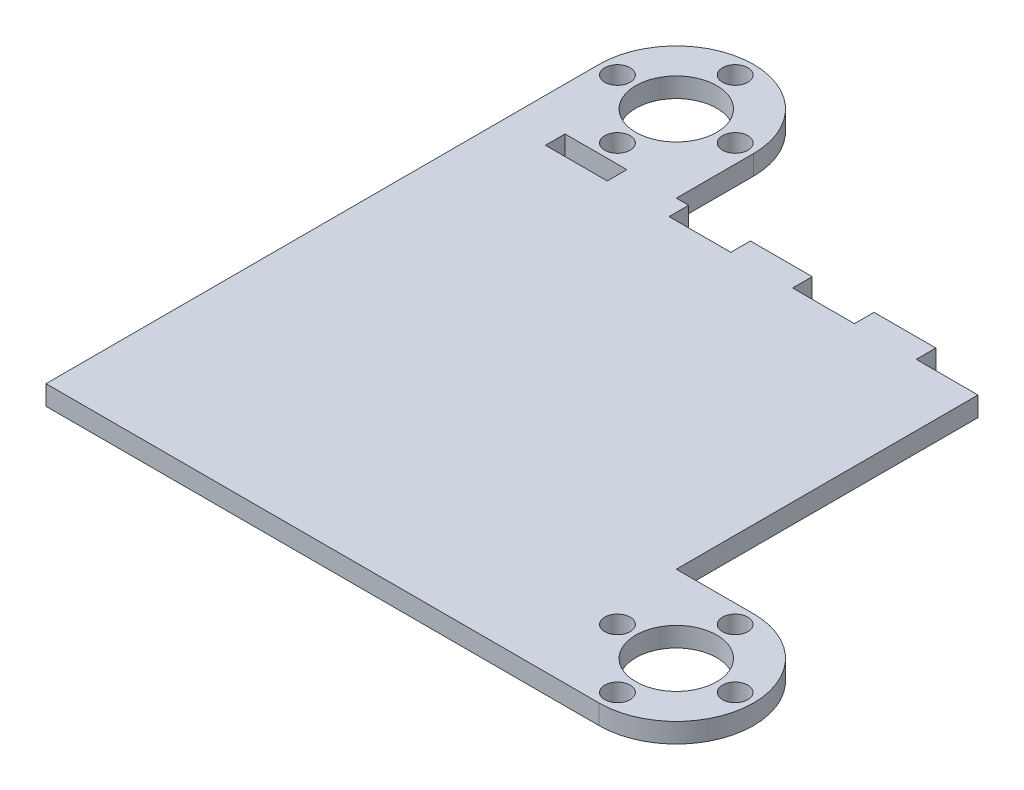
ISO-10303-21;
HEADER;
FILE_DESCRIPTION(('STEP AP214'),'2;1');
FILE_NAME('part.step','',(''),(''),'','','');
FILE_SCHEMA(('AUTOMOTIVE_DESIGN { 1 0 10303 214 1 1 1 1 }'));
ENDSEC;
DATA;
#1=APPLICATION_CONTEXT('core data for automotive mechanical design processes');
#2=APPLICATION_PROTOCOL_DEFINITION('international standard','automotive_design',2000,#1);
#3=PRODUCT_CONTEXT('',#1,'mechanical');
#4=PRODUCT('Part','Part','',(#3));
#5=PRODUCT_RELATED_PRODUCT_CATEGORY('part','',(#4));
#6=PRODUCT_DEFINITION_FORMATION('','',#4);
#7=PRODUCT_DEFINITION_CONTEXT('part definition',#1,'design');
#8=PRODUCT_DEFINITION('design','',#6,#7);
#9=PRODUCT_DEFINITION_SHAPE('','',#8);
#10=(LENGTH_UNIT() NAMED_UNIT(*) SI_UNIT(.MILLI.,.METRE.));
#11=(NAMED_UNIT(*) PLANE_ANGLE_UNIT() SI_UNIT($,.RADIAN.));
#12=(NAMED_UNIT(*) SI_UNIT($,.STERADIAN.) SOLID_ANGLE_UNIT());
#13=UNCERTAINTY_MEASURE_WITH_UNIT(LENGTH_MEASURE(1.E-05),#10,'distance_accuracy_value','');
#14=(GEOMETRIC_REPRESENTATION_CONTEXT(3) GLOBAL_UNCERTAINTY_ASSIGNED_CONTEXT((#13)) GLOBAL_UNIT_ASSIGNED_CONTEXT((#10,
#11,#12)) REPRESENTATION_CONTEXT('',''));
#15=CARTESIAN_POINT('',(0.,0.,0.));
#16=DIRECTION('',(0.,0.,1.));
#17=DIRECTION('',(1.,0.,0.));
#18=AXIS2_PLACEMENT_3D('',#15,#16,#17);
#19=CARTESIAN_POINT('',(0.,3.175,-38.5));
#20=DIRECTION('',(0.,0.,-1.));
#21=DIRECTION('',(-1.,0.,0.));
#22=AXIS2_PLACEMENT_3D('',#19,#20,#21);
#23=PLANE('',#22);
#24=DIRECTION('',(0.,1.,0.));
#25=VECTOR('',#24,1.);
#26=CARTESIAN_POINT('',(28.5,0.,-38.5));
#27=LINE('',#26,#25);
#28=CARTESIAN_POINT('',(28.5,0.,-38.5));
#29=VERTEX_POINT('',#28);
#30=CARTESIAN_POINT('',(28.5,3.175,-38.5));
#31=VERTEX_POINT('',#30);
#32=EDGE_CURVE('E193',#29,#31,#27,.T.);
#33=ORIENTED_EDGE('',*,*,#32,.F.);
#34=DIRECTION('',(1.,0.,0.));
#35=VECTOR('',#34,1.);
#36=CARTESIAN_POINT('',(0.,0.,-38.5));
#37=LINE('',#36,#35);
#38=CARTESIAN_POINT('',(18.5,0.,-38.4999999999999));
#39=VERTEX_POINT('',#38);
#40=EDGE_CURVE('E205',#39,#29,#37,.T.);
#41=ORIENTED_EDGE('',*,*,#40,.F.);
#42=DIRECTION('',(0.,1.,0.));
#43=VECTOR('',#42,1.);
#44=CARTESIAN_POINT('',(18.5,0.,-38.4999999999999));
#45=LINE('',#44,#43);
#46=CARTESIAN_POINT('',(18.5,3.175,-38.4999999999999));
#47=VERTEX_POINT('',#46);
#48=EDGE_CURVE('E553',#39,#47,#45,.T.);
#49=ORIENTED_EDGE('',*,*,#48,.T.);
#50=DIRECTION('',(1.,0.,0.));
#51=VECTOR('',#50,1.);
#52=CARTESIAN_POINT('',(0.,3.175,-38.5));
#53=LINE('',#52,#51);
#54=EDGE_CURVE('E207',#47,#31,#53,.T.);
#55=ORIENTED_EDGE('',*,*,#54,.T.);
#56=EDGE_LOOP('',(#33,#41,#49,#55));
#57=FACE_BOUND('',#56,.T.);
#58=ADVANCED_FACE('F41',(#57),#23,.T.);
#59=DIRECTION('',(0.,1.,0.));
#60=VECTOR('',#59,1.);
#61=CARTESIAN_POINT('',(8.49999999999999,0.,-38.4999999999999));
#62=LINE('',#61,#60);
#63=CARTESIAN_POINT('',(8.49999999999999,0.,-38.4999999999999));
#64=VERTEX_POINT('',#63);
#65=CARTESIAN_POINT('',(8.49999999999999,3.175,-38.4999999999999));
#66=VERTEX_POINT('',#65);
#67=EDGE_CURVE('E550',#64,#66,#62,.T.);
#68=ORIENTED_EDGE('',*,*,#67,.F.);
#69=CARTESIAN_POINT('',(-1.50000000000001,0.,-38.4999999999997));
#70=VERTEX_POINT('',#69);
#71=EDGE_CURVE('E217',#70,#64,#37,.T.);
#72=ORIENTED_EDGE('',*,*,#71,.F.);
#73=DIRECTION('',(0.,1.,0.));
#74=VECTOR('',#73,1.);
#75=CARTESIAN_POINT('',(-1.50000000000001,0.,-38.4999999999997));
#76=LINE('',#75,#74);
#77=CARTESIAN_POINT('',(-1.50000000000001,3.175,-38.4999999999997));
#78=VERTEX_POINT('',#77);
#79=EDGE_CURVE('E447',#70,#78,#76,.T.);
#80=ORIENTED_EDGE('',*,*,#79,.T.);
#81=EDGE_CURVE('E353',#78,#66,#53,.T.);
#82=ORIENTED_EDGE('',*,*,#81,.T.);
#83=EDGE_LOOP('',(#68,#72,#80,#82));
#84=FACE_BOUND('',#83,.T.);
#85=ADVANCED_FACE('F419',(#84),#23,.T.);
#86=CARTESIAN_POINT('',(-38.5,3.175,0.));
#87=DIRECTION('',(1.,0.,0.));
#88=DIRECTION('',(0.,0.,-1.));
#89=AXIS2_PLACEMENT_3D('',#86,#87,#88);
#90=PLANE('',#89);
#91=DIRECTION('',(0.,0.,1.));
#92=VECTOR('',#91,1.);
#93=CARTESIAN_POINT('',(-38.5,0.,0.));
#94=LINE('',#93,#92);
#95=CARTESIAN_POINT('',(-38.5,0.,-51.));
#96=VERTEX_POINT('',#95);
#97=CARTESIAN_POINT('',(-38.5,0.,38.5));
#98=VERTEX_POINT('',#97);
#99=EDGE_CURVE('E322',#96,#98,#94,.T.);
#100=ORIENTED_EDGE('',*,*,#99,.T.);
#101=DIRECTION('',(0.,-1.,0.));
#102=VECTOR('',#101,1.);
#103=CARTESIAN_POINT('',(-38.5,3.175,38.5));
#104=LINE('',#103,#102);
#105=CARTESIAN_POINT('',(-38.5,3.175,38.5));
#106=VERTEX_POINT('',#105);
#107=EDGE_CURVE('E11',#106,#98,#104,.T.);
#108=ORIENTED_EDGE('',*,*,#107,.F.);
#109=DIRECTION('',(0.,0.,1.));
#110=VECTOR('',#109,1.);
#111=CARTESIAN_POINT('',(-38.5,3.175,0.));
#112=LINE('',#111,#110);
#113=CARTESIAN_POINT('',(-38.5,3.175,-51.));
#114=VERTEX_POINT('',#113);
#115=EDGE_CURVE('E280',#114,#106,#112,.T.);
#116=ORIENTED_EDGE('',*,*,#115,.F.);
#117=DIRECTION('',(0.,-1.,0.));
#118=VECTOR('',#117,1.);
#119=CARTESIAN_POINT('',(-38.5,3.175,-51.));
#120=LINE('',#119,#118);
#121=EDGE_CURVE('E281',#114,#96,#120,.T.);
#122=ORIENTED_EDGE('',*,*,#121,.T.);
#123=EDGE_LOOP('',(#100,#108,#116,#122));
#124=FACE_BOUND('',#123,.T.);
#125=ADVANCED_FACE('F43',(#124),#90,.F.);
#126=CARTESIAN_POINT('',(0.,3.175,38.5));
#127=DIRECTION('',(0.,0.,1.));
#128=DIRECTION('',(1.,0.,0.));
#129=AXIS2_PLACEMENT_3D('',#126,#127,#128);
#130=PLANE('',#129);
#131=DIRECTION('',(-1.,0.,0.));
#132=VECTOR('',#131,1.);
#133=CARTESIAN_POINT('',(0.,0.,38.5));
#134=LINE('',#133,#132);
#135=CARTESIAN_POINT('',(51.,0.,38.5));
#136=VERTEX_POINT('',#135);
#137=EDGE_CURVE('E314',#136,#98,#134,.T.);
#138=ORIENTED_EDGE('',*,*,#137,.F.);
#139=DIRECTION('',(0.,-1.,0.));
#140=VECTOR('',#139,1.);
#141=CARTESIAN_POINT('',(51.,3.175,38.5));
#142=LINE('',#141,#140);
#143=CARTESIAN_POINT('',(51.,3.175,38.5));
#144=VERTEX_POINT('',#143);
#145=EDGE_CURVE('E50',#144,#136,#142,.T.);
#146=ORIENTED_EDGE('',*,*,#145,.F.);
#147=DIRECTION('',(-1.,0.,0.));
#148=VECTOR('',#147,1.);
#149=CARTESIAN_POINT('',(0.,3.175,38.5));
#150=LINE('',#149,#148);
#151=EDGE_CURVE('E344',#144,#106,#150,.T.);
#152=ORIENTED_EDGE('',*,*,#151,.T.);
#153=ORIENTED_EDGE('',*,*,#107,.T.);
#154=EDGE_LOOP('',(#138,#146,#152,#153));
#155=FACE_BOUND('',#154,.T.);
#156=ADVANCED_FACE('F318',(#155),#130,.T.);
#157=CARTESIAN_POINT('',(51.,3.175,26.));
#158=DIRECTION('',(0.,-1.,0.));
#159=DIRECTION('',(0.,0.,-1.));
#160=AXIS2_PLACEMENT_3D('',#157,#158,#159);
#161=CYLINDRICAL_SURFACE('',#160,12.5);
#162=CARTESIAN_POINT('',(51.,0.,26.));
#163=DIRECTION('',(0.,1.,0.));
#164=DIRECTION('',(0.,0.,1.));
#165=AXIS2_PLACEMENT_3D('',#162,#163,#164);
#166=CIRCLE('',#165,12.5);
#167=CARTESIAN_POINT('',(51.,0.,13.5));
#168=VERTEX_POINT('',#167);
#169=EDGE_CURVE('E305',#136,#168,#166,.T.);
#170=ORIENTED_EDGE('',*,*,#169,.T.);
#171=DIRECTION('',(0.,-1.,0.));
#172=VECTOR('',#171,1.);
#173=CARTESIAN_POINT('',(51.,3.175,13.5));
#174=LINE('',#173,#172);
#175=CARTESIAN_POINT('',(51.,3.175,13.5));
#176=VERTEX_POINT('',#175);
#177=EDGE_CURVE('E296',#176,#168,#174,.T.);
#178=ORIENTED_EDGE('',*,*,#177,.F.);
#179=CARTESIAN_POINT('',(51.,3.175,26.));
#180=DIRECTION('',(0.,1.,0.));
#181=DIRECTION('',(0.,0.,1.));
#182=AXIS2_PLACEMENT_3D('',#179,#180,#181);
#183=CIRCLE('',#182,12.5);
#184=EDGE_CURVE('E306',#144,#176,#183,.T.);
#185=ORIENTED_EDGE('',*,*,#184,.F.);
#186=ORIENTED_EDGE('',*,*,#145,.T.);
#187=EDGE_LOOP('',(#170,#178,#185,#186));
#188=FACE_BOUND('',#187,.T.);
#189=ADVANCED_FACE('F303',(#188),#161,.T.);
#190=CARTESIAN_POINT('',(0.,3.175,13.5));
#191=DIRECTION('',(0.,0.,1.));
#192=DIRECTION('',(1.,0.,0.));
#193=AXIS2_PLACEMENT_3D('',#190,#191,#192);
#194=PLANE('',#193);
#195=DIRECTION('',(-1.,0.,0.));
#196=VECTOR('',#195,1.);
#197=CARTESIAN_POINT('',(0.,0.,13.5));
#198=LINE('',#197,#196);
#199=CARTESIAN_POINT('',(38.5,0.,13.5));
#200=VERTEX_POINT('',#199);
#201=EDGE_CURVE('E224',#168,#200,#198,.T.);
#202=ORIENTED_EDGE('',*,*,#201,.T.);
#203=DIRECTION('',(0.,-1.,0.));
#204=VECTOR('',#203,1.);
#205=CARTESIAN_POINT('',(38.5,3.175,13.5));
#206=LINE('',#205,#204);
#207=CARTESIAN_POINT('',(38.5,3.175,13.5));
#208=VERTEX_POINT('',#207);
#209=EDGE_CURVE('E292',#208,#200,#206,.T.);
#210=ORIENTED_EDGE('',*,*,#209,.F.);
#211=DIRECTION('',(-1.,0.,0.));
#212=VECTOR('',#211,1.);
#213=CARTESIAN_POINT('',(0.,3.175,13.5));
#214=LINE('',#213,#212);
#215=EDGE_CURVE('E335',#176,#208,#214,.T.);
#216=ORIENTED_EDGE('',*,*,#215,.F.);
#217=ORIENTED_EDGE('',*,*,#177,.T.);
#218=EDGE_LOOP('',(#202,#210,#216,#217));
#219=FACE_BOUND('',#218,.T.);
#220=ADVANCED_FACE('F332',(#219),#194,.F.);
#221=CARTESIAN_POINT('',(38.5,3.175,0.));
#222=DIRECTION('',(1.,0.,0.));
#223=DIRECTION('',(0.,0.,-1.));
#224=AXIS2_PLACEMENT_3D('',#221,#222,#223);
#225=PLANE('',#224);
#226=DIRECTION('',(0.,1.,0.));
#227=VECTOR('',#226,1.);
#228=CARTESIAN_POINT('',(38.5,0.,-35.325));
#229=LINE('',#228,#227);
#230=CARTESIAN_POINT('',(38.5,0.,-35.325));
#231=VERTEX_POINT('',#230);
#232=CARTESIAN_POINT('',(38.5,3.175,-35.325));
#233=VERTEX_POINT('',#232);
#234=EDGE_CURVE('E325',#231,#233,#229,.T.);
#235=ORIENTED_EDGE('',*,*,#234,.T.);
#236=DIRECTION('',(0.,0.,1.));
#237=VECTOR('',#236,1.);
#238=CARTESIAN_POINT('',(38.5,3.175,0.));
#239=LINE('',#238,#237);
#240=EDGE_CURVE('E339',#233,#208,#239,.T.);
#241=ORIENTED_EDGE('',*,*,#240,.T.);
#242=ORIENTED_EDGE('',*,*,#209,.T.);
#243=DIRECTION('',(0.,0.,1.));
#244=VECTOR('',#243,1.);
#245=CARTESIAN_POINT('',(38.5,0.,0.));
#246=LINE('',#245,#244);
#247=EDGE_CURVE('E218',#231,#200,#246,.T.);
#248=ORIENTED_EDGE('',*,*,#247,.F.);
#249=EDGE_LOOP('',(#235,#241,#242,#248));
#250=FACE_BOUND('',#249,.T.);
#251=ADVANCED_FACE('F430',(#250),#225,.T.);
#252=DIRECTION('',(0.,1.,0.));
#253=VECTOR('',#252,1.);
#254=CARTESIAN_POINT('',(-11.5,0.,-38.4999999999997));
#255=LINE('',#254,#253);
#256=CARTESIAN_POINT('',(-11.5,0.,-38.4999999999997));
#257=VERTEX_POINT('',#256);
#258=CARTESIAN_POINT('',(-11.5,3.175,-38.4999999999997));
#259=VERTEX_POINT('',#258);
#260=EDGE_CURVE('E440',#257,#259,#255,.T.);
#261=ORIENTED_EDGE('',*,*,#260,.F.);
#262=CARTESIAN_POINT('',(-13.5,0.,-38.5));
#263=VERTEX_POINT('',#262);
#264=EDGE_CURVE('E220',#263,#257,#37,.T.);
#265=ORIENTED_EDGE('',*,*,#264,.F.);
#266=DIRECTION('',(0.,-1.,0.));
#267=VECTOR('',#266,1.);
#268=CARTESIAN_POINT('',(-13.5,3.175,-38.5));
#269=LINE('',#268,#267);
#270=CARTESIAN_POINT('',(-13.5,3.175,-38.5));
#271=VERTEX_POINT('',#270);
#272=EDGE_CURVE('E289',#271,#263,#269,.T.);
#273=ORIENTED_EDGE('',*,*,#272,.F.);
#274=EDGE_CURVE('E348',#271,#259,#53,.T.);
#275=ORIENTED_EDGE('',*,*,#274,.T.);
#276=EDGE_LOOP('',(#261,#265,#273,#275));
#277=FACE_BOUND('',#276,.T.);
#278=ADVANCED_FACE('F421',(#277),#23,.T.);
#279=CARTESIAN_POINT('',(-13.5,3.175,0.));
#280=DIRECTION('',(1.,0.,0.));
#281=DIRECTION('',(0.,0.,-1.));
#282=AXIS2_PLACEMENT_3D('',#279,#280,#281);
#283=PLANE('',#282);
#284=DIRECTION('',(0.,0.,1.));
#285=VECTOR('',#284,1.);
#286=CARTESIAN_POINT('',(-13.5,0.,0.));
#287=LINE('',#286,#285);
#288=CARTESIAN_POINT('',(-13.5,0.,-51.));
#289=VERTEX_POINT('',#288);
#290=EDGE_CURVE('E229',#289,#263,#287,.T.);
#291=ORIENTED_EDGE('',*,*,#290,.F.);
#292=DIRECTION('',(0.,-1.,0.));
#293=VECTOR('',#292,1.);
#294=CARTESIAN_POINT('',(-13.5,3.175,-51.));
#295=LINE('',#294,#293);
#296=CARTESIAN_POINT('',(-13.5,3.175,-51.));
#297=VERTEX_POINT('',#296);
#298=EDGE_CURVE('E285',#297,#289,#295,.T.);
#299=ORIENTED_EDGE('',*,*,#298,.F.);
#300=DIRECTION('',(0.,0.,1.));
#301=VECTOR('',#300,1.);
#302=CARTESIAN_POINT('',(-13.5,3.175,0.));
#303=LINE('',#302,#301);
#304=EDGE_CURVE('E352',#297,#271,#303,.T.);
#305=ORIENTED_EDGE('',*,*,#304,.T.);
#306=ORIENTED_EDGE('',*,*,#272,.T.);
#307=EDGE_LOOP('',(#291,#299,#305,#306));
#308=FACE_BOUND('',#307,.T.);
#309=ADVANCED_FACE('F429',(#308),#283,.T.);
#310=CARTESIAN_POINT('',(51.,3.175,26.));
#311=DIRECTION('',(0.,-1.,0.));
#312=DIRECTION('',(0.,0.,-1.));
#313=AXIS2_PLACEMENT_3D('',#310,#311,#312);
#314=CYLINDRICAL_SURFACE('',#313,6.55);
#315=CARTESIAN_POINT('',(51.,3.175,26.));
#316=DIRECTION('',(0.,1.,0.));
#317=DIRECTION('',(0.,0.,1.));
#318=AXIS2_PLACEMENT_3D('',#315,#316,#317);
#319=CIRCLE('',#318,6.55);
#320=CARTESIAN_POINT('',(51.,3.175,32.55));
#321=VERTEX_POINT('',#320);
#322=EDGE_CURVE('E392',#321,#321,#319,.T.);
#323=ORIENTED_EDGE('',*,*,#322,.T.);
#324=EDGE_LOOP('',(#323));
#325=FACE_BOUND('',#324,.T.);
#326=CARTESIAN_POINT('',(51.,0.,26.));
#327=DIRECTION('',(0.,1.,0.));
#328=DIRECTION('',(0.,0.,1.));
#329=AXIS2_PLACEMENT_3D('',#326,#327,#328);
#330=CIRCLE('',#329,6.55);
#331=CARTESIAN_POINT('',(51.,0.,32.55));
#332=VERTEX_POINT('',#331);
#333=EDGE_CURVE('E272',#332,#332,#330,.T.);
#334=ORIENTED_EDGE('',*,*,#333,.F.);
#335=EDGE_LOOP('',(#334));
#336=FACE_BOUND('',#335,.T.);
#337=ADVANCED_FACE('F436',(#325,#336),#314,.F.);
#338=CARTESIAN_POINT('',(-26.,3.175,-60.525));
#339=DIRECTION('',(0.,-1.,0.));
#340=DIRECTION('',(0.,0.,-1.));
#341=AXIS2_PLACEMENT_3D('',#338,#339,#340);
#342=CYLINDRICAL_SURFACE('',#341,2.05);
#343=CARTESIAN_POINT('',(-26.,3.175,-60.525));
#344=DIRECTION('',(0.,1.,0.));
#345=DIRECTION('',(0.,0.,1.));
#346=AXIS2_PLACEMENT_3D('',#343,#344,#345);
#347=CIRCLE('',#346,2.05);
#348=CARTESIAN_POINT('',(-26.,3.175,-58.475));
#349=VERTEX_POINT('',#348);
#350=EDGE_CURVE('E388',#349,#349,#347,.T.);
#351=ORIENTED_EDGE('',*,*,#350,.T.);
#352=EDGE_LOOP('',(#351));
#353=FACE_BOUND('',#352,.T.);
#354=CARTESIAN_POINT('',(-26.,0.,-60.525));
#355=DIRECTION('',(0.,1.,0.));
#356=DIRECTION('',(0.,0.,1.));
#357=AXIS2_PLACEMENT_3D('',#354,#355,#356);
#358=CIRCLE('',#357,2.05);
#359=CARTESIAN_POINT('',(-26.,0.,-58.475));
#360=VERTEX_POINT('',#359);
#361=EDGE_CURVE('E268',#360,#360,#358,.T.);
#362=ORIENTED_EDGE('',*,*,#361,.F.);
#363=EDGE_LOOP('',(#362));
#364=FACE_BOUND('',#363,.T.);
#365=ADVANCED_FACE('F792',(#353,#364),#342,.F.);
#366=CARTESIAN_POINT('',(51.,3.175,16.475));
#367=DIRECTION('',(0.,-1.,0.));
#368=DIRECTION('',(0.,0.,-1.));
#369=AXIS2_PLACEMENT_3D('',#366,#367,#368);
#370=CYLINDRICAL_SURFACE('',#369,2.05);
#371=CARTESIAN_POINT('',(51.,3.175,16.475));
#372=DIRECTION('',(0.,1.,0.));
#373=DIRECTION('',(0.,0.,1.));
#374=AXIS2_PLACEMENT_3D('',#371,#372,#373);
#375=CIRCLE('',#374,2.05);
#376=CARTESIAN_POINT('',(51.,3.175,18.525));
#377=VERTEX_POINT('',#376);
#378=EDGE_CURVE('E384',#377,#377,#375,.T.);
#379=ORIENTED_EDGE('',*,*,#378,.T.);
#380=EDGE_LOOP('',(#379));
#381=FACE_BOUND('',#380,.T.);
#382=CARTESIAN_POINT('',(51.,0.,16.475));
#383=DIRECTION('',(0.,1.,0.));
#384=DIRECTION('',(0.,0.,1.));
#385=AXIS2_PLACEMENT_3D('',#382,#383,#384);
#386=CIRCLE('',#385,2.05);
#387=CARTESIAN_POINT('',(51.,0.,18.525));
#388=VERTEX_POINT('',#387);
#389=EDGE_CURVE('E264',#388,#388,#386,.T.);
#390=ORIENTED_EDGE('',*,*,#389,.F.);
#391=EDGE_LOOP('',(#390));
#392=FACE_BOUND('',#391,.T.);
#393=ADVANCED_FACE('F783',(#381,#392),#370,.F.);
#394=CARTESIAN_POINT('',(-16.4749999999999,3.175,-51.0000000000001));
#395=DIRECTION('',(0.,-1.,0.));
#396=DIRECTION('',(0.,0.,-1.));
#397=AXIS2_PLACEMENT_3D('',#394,#395,#396);
#398=CYLINDRICAL_SURFACE('',#397,2.05000000000001);
#399=CARTESIAN_POINT('',(-16.4749999999999,3.175,-51.0000000000001));
#400=DIRECTION('',(0.,1.,0.));
#401=DIRECTION('',(0.,0.,1.));
#402=AXIS2_PLACEMENT_3D('',#399,#400,#401);
#403=CIRCLE('',#402,2.05000000000001);
#404=CARTESIAN_POINT('',(-16.4749999999999,3.175,-48.9500000000001));
#405=VERTEX_POINT('',#404);
#406=EDGE_CURVE('E380',#405,#405,#403,.T.);
#407=ORIENTED_EDGE('',*,*,#406,.T.);
#408=EDGE_LOOP('',(#407));
#409=FACE_BOUND('',#408,.T.);
#410=CARTESIAN_POINT('',(-16.4749999999999,0.,-51.0000000000001));
#411=DIRECTION('',(0.,1.,0.));
#412=DIRECTION('',(0.,0.,1.));
#413=AXIS2_PLACEMENT_3D('',#410,#411,#412);
#414=CIRCLE('',#413,2.05000000000001);
#415=CARTESIAN_POINT('',(-16.4749999999999,0.,-48.9500000000001));
#416=VERTEX_POINT('',#415);
#417=EDGE_CURVE('E260',#416,#416,#414,.T.);
#418=ORIENTED_EDGE('',*,*,#417,.F.);
#419=EDGE_LOOP('',(#418));
#420=FACE_BOUND('',#419,.T.);
#421=ADVANCED_FACE('F774',(#409,#420),#398,.F.);
#422=CARTESIAN_POINT('',(-25.9999999999998,3.175,-41.475));
#423=DIRECTION('',(0.,-1.,0.));
#424=DIRECTION('',(0.,0.,-1.));
#425=AXIS2_PLACEMENT_3D('',#422,#423,#424);
#426=CYLINDRICAL_SURFACE('',#425,2.05);
#427=CARTESIAN_POINT('',(-25.9999999999998,3.175,-41.475));
#428=DIRECTION('',(0.,1.,0.));
#429=DIRECTION('',(0.,0.,1.));
#430=AXIS2_PLACEMENT_3D('',#427,#428,#429);
#431=CIRCLE('',#430,2.05);
#432=CARTESIAN_POINT('',(-25.9999999999998,3.175,-39.425));
#433=VERTEX_POINT('',#432);
#434=EDGE_CURVE('E376',#433,#433,#431,.T.);
#435=ORIENTED_EDGE('',*,*,#434,.T.);
#436=EDGE_LOOP('',(#435));
#437=FACE_BOUND('',#436,.T.);
#438=CARTESIAN_POINT('',(-25.9999999999998,0.,-41.475));
#439=DIRECTION('',(0.,1.,0.));
#440=DIRECTION('',(0.,0.,1.));
#441=AXIS2_PLACEMENT_3D('',#438,#439,#440);
#442=CIRCLE('',#441,2.05);
#443=CARTESIAN_POINT('',(-25.9999999999998,0.,-39.425));
#444=VERTEX_POINT('',#443);
#445=EDGE_CURVE('E256',#444,#444,#442,.T.);
#446=ORIENTED_EDGE('',*,*,#445,.F.);
#447=EDGE_LOOP('',(#446));
#448=FACE_BOUND('',#447,.T.);
#449=ADVANCED_FACE('F765',(#437,#448),#426,.F.);
#450=CARTESIAN_POINT('',(-35.5249999999999,3.175,-51.));
#451=DIRECTION('',(0.,-1.,0.));
#452=DIRECTION('',(0.,0.,-1.));
#453=AXIS2_PLACEMENT_3D('',#450,#451,#452);
#454=CYLINDRICAL_SURFACE('',#453,2.05);
#455=CARTESIAN_POINT('',(-35.5249999999999,3.175,-51.));
#456=DIRECTION('',(0.,1.,0.));
#457=DIRECTION('',(0.,0.,1.));
#458=AXIS2_PLACEMENT_3D('',#455,#456,#457);
#459=CIRCLE('',#458,2.05);
#460=CARTESIAN_POINT('',(-35.5249999999999,3.175,-48.95));
#461=VERTEX_POINT('',#460);
#462=EDGE_CURVE('E372',#461,#461,#459,.T.);
#463=ORIENTED_EDGE('',*,*,#462,.T.);
#464=EDGE_LOOP('',(#463));
#465=FACE_BOUND('',#464,.T.);
#466=CARTESIAN_POINT('',(-35.5249999999999,0.,-51.));
#467=DIRECTION('',(0.,1.,0.));
#468=DIRECTION('',(0.,0.,1.));
#469=AXIS2_PLACEMENT_3D('',#466,#467,#468);
#470=CIRCLE('',#469,2.05);
#471=CARTESIAN_POINT('',(-35.5249999999999,0.,-48.95));
#472=VERTEX_POINT('',#471);
#473=EDGE_CURVE('E252',#472,#472,#470,.T.);
#474=ORIENTED_EDGE('',*,*,#473,.F.);
#475=EDGE_LOOP('',(#474));
#476=FACE_BOUND('',#475,.T.);
#477=ADVANCED_FACE('F756',(#465,#476),#454,.F.);
#478=CARTESIAN_POINT('',(60.5250000000001,3.175,25.9999999999999));
#479=DIRECTION('',(0.,-1.,0.));
#480=DIRECTION('',(0.,0.,-1.));
#481=AXIS2_PLACEMENT_3D('',#478,#479,#480);
#482=CYLINDRICAL_SURFACE('',#481,2.05);
#483=CARTESIAN_POINT('',(60.5250000000001,3.175,25.9999999999999));
#484=DIRECTION('',(0.,1.,0.));
#485=DIRECTION('',(0.,0.,1.));
#486=AXIS2_PLACEMENT_3D('',#483,#484,#485);
#487=CIRCLE('',#486,2.05);
#488=CARTESIAN_POINT('',(60.5250000000001,3.175,28.0499999999999));
#489=VERTEX_POINT('',#488);
#490=EDGE_CURVE('E368',#489,#489,#487,.T.);
#491=ORIENTED_EDGE('',*,*,#490,.T.);
#492=EDGE_LOOP('',(#491));
#493=FACE_BOUND('',#492,.T.);
#494=CARTESIAN_POINT('',(60.5250000000001,0.,25.9999999999999));
#495=DIRECTION('',(0.,1.,0.));
#496=DIRECTION('',(0.,0.,1.));
#497=AXIS2_PLACEMENT_3D('',#494,#495,#496);
#498=CIRCLE('',#497,2.05);
#499=CARTESIAN_POINT('',(60.5250000000001,0.,28.0499999999999));
#500=VERTEX_POINT('',#499);
#501=EDGE_CURVE('E248',#500,#500,#498,.T.);
#502=ORIENTED_EDGE('',*,*,#501,.F.);
#503=EDGE_LOOP('',(#502));
#504=FACE_BOUND('',#503,.T.);
#505=ADVANCED_FACE('F747',(#493,#504),#482,.F.);
#506=CARTESIAN_POINT('',(51.0000000000002,3.175,35.525));
#507=DIRECTION('',(0.,-1.,0.));
#508=DIRECTION('',(0.,0.,-1.));
#509=AXIS2_PLACEMENT_3D('',#506,#507,#508);
#510=CYLINDRICAL_SURFACE('',#509,2.05);
#511=CARTESIAN_POINT('',(51.0000000000002,3.175,35.525));
#512=DIRECTION('',(0.,1.,0.));
#513=DIRECTION('',(0.,0.,1.));
#514=AXIS2_PLACEMENT_3D('',#511,#512,#513);
#515=CIRCLE('',#514,2.05);
#516=CARTESIAN_POINT('',(51.0000000000002,3.175,37.575));
#517=VERTEX_POINT('',#516);
#518=EDGE_CURVE('E364',#517,#517,#515,.T.);
#519=ORIENTED_EDGE('',*,*,#518,.T.);
#520=EDGE_LOOP('',(#519));
#521=FACE_BOUND('',#520,.T.);
#522=CARTESIAN_POINT('',(51.0000000000002,0.,35.525));
#523=DIRECTION('',(0.,1.,0.));
#524=DIRECTION('',(0.,0.,1.));
#525=AXIS2_PLACEMENT_3D('',#522,#523,#524);
#526=CIRCLE('',#525,2.05);
#527=CARTESIAN_POINT('',(51.0000000000002,0.,37.575));
#528=VERTEX_POINT('',#527);
#529=EDGE_CURVE('E244',#528,#528,#526,.T.);
#530=ORIENTED_EDGE('',*,*,#529,.F.);
#531=EDGE_LOOP('',(#530));
#532=FACE_BOUND('',#531,.T.);
#533=ADVANCED_FACE('F738',(#521,#532),#510,.F.);
#534=CARTESIAN_POINT('',(41.4750000000001,3.175,26.));
#535=DIRECTION('',(0.,-1.,0.));
#536=DIRECTION('',(0.,0.,-1.));
#537=AXIS2_PLACEMENT_3D('',#534,#535,#536);
#538=CYLINDRICAL_SURFACE('',#537,2.05);
#539=CARTESIAN_POINT('',(41.4750000000001,3.175,26.));
#540=DIRECTION('',(0.,1.,0.));
#541=DIRECTION('',(0.,0.,1.));
#542=AXIS2_PLACEMENT_3D('',#539,#540,#541);
#543=CIRCLE('',#542,2.05);
#544=CARTESIAN_POINT('',(41.4750000000001,3.175,28.05));
#545=VERTEX_POINT('',#544);
#546=EDGE_CURVE('E360',#545,#545,#543,.T.);
#547=ORIENTED_EDGE('',*,*,#546,.T.);
#548=EDGE_LOOP('',(#547));
#549=FACE_BOUND('',#548,.T.);
#550=CARTESIAN_POINT('',(41.4750000000001,0.,26.));
#551=DIRECTION('',(0.,1.,0.));
#552=DIRECTION('',(0.,0.,1.));
#553=AXIS2_PLACEMENT_3D('',#550,#551,#552);
#554=CIRCLE('',#553,2.05);
#555=CARTESIAN_POINT('',(41.4750000000001,0.,28.05));
#556=VERTEX_POINT('',#555);
#557=EDGE_CURVE('E238',#556,#556,#554,.T.);
#558=ORIENTED_EDGE('',*,*,#557,.F.);
#559=EDGE_LOOP('',(#558));
#560=FACE_BOUND('',#559,.T.);
#561=ADVANCED_FACE('F730',(#549,#560),#538,.F.);
#562=CARTESIAN_POINT('',(-26.,3.175,-51.));
#563=DIRECTION('',(0.,-1.,0.));
#564=DIRECTION('',(0.,0.,-1.));
#565=AXIS2_PLACEMENT_3D('',#562,#563,#564);
#566=CYLINDRICAL_SURFACE('',#565,12.5);
#567=CARTESIAN_POINT('',(-26.,0.,-51.));
#568=DIRECTION('',(0.,1.,0.));
#569=DIRECTION('',(0.,0.,1.));
#570=AXIS2_PLACEMENT_3D('',#567,#568,#569);
#571=CIRCLE('',#570,12.5);
#572=EDGE_CURVE('E234',#289,#96,#571,.T.);
#573=ORIENTED_EDGE('',*,*,#572,.T.);
#574=ORIENTED_EDGE('',*,*,#121,.F.);
#575=CARTESIAN_POINT('',(-26.,3.175,-51.));
#576=DIRECTION('',(0.,1.,0.));
#577=DIRECTION('',(0.,0.,1.));
#578=AXIS2_PLACEMENT_3D('',#575,#576,#577);
#579=CIRCLE('',#578,12.5);
#580=EDGE_CURVE('E357',#297,#114,#579,.T.);
#581=ORIENTED_EDGE('',*,*,#580,.F.);
#582=ORIENTED_EDGE('',*,*,#298,.T.);
#583=EDGE_LOOP('',(#573,#574,#581,#582));
#584=FACE_BOUND('',#583,.T.);
#585=ADVANCED_FACE('F413',(#584),#566,.T.);
#586=CARTESIAN_POINT('',(-26.,3.175,-51.));
#587=DIRECTION('',(0.,-1.,0.));
#588=DIRECTION('',(0.,0.,-1.));
#589=AXIS2_PLACEMENT_3D('',#586,#587,#588);
#590=CYLINDRICAL_SURFACE('',#589,6.55);
#591=CARTESIAN_POINT('',(-26.,3.175,-51.));
#592=DIRECTION('',(0.,1.,0.));
#593=DIRECTION('',(0.,0.,1.));
#594=AXIS2_PLACEMENT_3D('',#591,#592,#593);
#595=CIRCLE('',#594,6.55);
#596=CARTESIAN_POINT('',(-26.,3.175,-44.45));
#597=VERTEX_POINT('',#596);
#598=EDGE_CURVE('E286',#597,#597,#595,.T.);
#599=ORIENTED_EDGE('',*,*,#598,.T.);
#600=EDGE_LOOP('',(#599));
#601=FACE_BOUND('',#600,.T.);
#602=CARTESIAN_POINT('',(-26.,0.,-51.));
#603=DIRECTION('',(0.,1.,0.));
#604=DIRECTION('',(0.,0.,1.));
#605=AXIS2_PLACEMENT_3D('',#602,#603,#604);
#606=CIRCLE('',#605,6.55);
#607=CARTESIAN_POINT('',(-26.,0.,-44.45));
#608=VERTEX_POINT('',#607);
#609=EDGE_CURVE('E276',#608,#608,#606,.T.);
#610=ORIENTED_EDGE('',*,*,#609,.F.);
#611=EDGE_LOOP('',(#610));
#612=FACE_BOUND('',#611,.T.);
#613=ADVANCED_FACE('F399',(#601,#612),#590,.F.);
#614=CARTESIAN_POINT('',(0.,3.175,0.));
#615=DIRECTION('',(0.,1.,0.));
#616=DIRECTION('',(0.,0.,1.));
#617=AXIS2_PLACEMENT_3D('',#614,#615,#616);
#618=PLANE('',#617);
#619=DIRECTION('',(1.,0.,0.));
#620=VECTOR('',#619,1.);
#621=CARTESIAN_POINT('',(38.5,3.175,-35.325));
#622=LINE('',#621,#620);
#623=CARTESIAN_POINT('',(28.5,3.175,-35.325));
#624=VERTEX_POINT('',#623);
#625=EDGE_CURVE('E199',#624,#233,#622,.T.);
#626=ORIENTED_EDGE('',*,*,#625,.F.);
#627=DIRECTION('',(0.,0.,1.));
#628=VECTOR('',#627,1.);
#629=CARTESIAN_POINT('',(28.5,3.175,-38.5));
#630=LINE('',#629,#628);
#631=EDGE_CURVE('E546',#31,#624,#630,.T.);
#632=ORIENTED_EDGE('',*,*,#631,.F.);
#633=ORIENTED_EDGE('',*,*,#54,.F.);
#634=DIRECTION('',(0.,0.,-1.));
#635=VECTOR('',#634,1.);
#636=CARTESIAN_POINT('',(18.5,3.175,-38.4999999999999));
#637=LINE('',#636,#635);
#638=CARTESIAN_POINT('',(18.5,3.175,-35.3249999999999));
#639=VERTEX_POINT('',#638);
#640=EDGE_CURVE('E524',#639,#47,#637,.T.);
#641=ORIENTED_EDGE('',*,*,#640,.F.);
#642=DIRECTION('',(1.,0.,0.));
#643=VECTOR('',#642,1.);
#644=CARTESIAN_POINT('',(18.5,3.175,-35.3249999999999));
#645=LINE('',#644,#643);
#646=CARTESIAN_POINT('',(8.49999999999999,3.175,-35.3249999999999));
#647=VERTEX_POINT('',#646);
#648=EDGE_CURVE('E534',#647,#639,#645,.T.);
#649=ORIENTED_EDGE('',*,*,#648,.F.);
#650=DIRECTION('',(0.,0.,1.));
#651=VECTOR('',#650,1.);
#652=CARTESIAN_POINT('',(8.49999999999999,3.175,-38.4999999999999));
#653=LINE('',#652,#651);
#654=EDGE_CURVE('E528',#66,#647,#653,.T.);
#655=ORIENTED_EDGE('',*,*,#654,.F.);
#656=ORIENTED_EDGE('',*,*,#81,.F.);
#657=DIRECTION('',(0.,0.,-1.));
#658=VECTOR('',#657,1.);
#659=CARTESIAN_POINT('',(-1.50000000000001,3.175,-38.4999999999997));
#660=LINE('',#659,#658);
#661=CARTESIAN_POINT('',(-1.50000000000001,3.175,-35.3249999999997));
#662=VERTEX_POINT('',#661);
#663=EDGE_CURVE('E492',#662,#78,#660,.T.);
#664=ORIENTED_EDGE('',*,*,#663,.F.);
#665=DIRECTION('',(1.,0.,0.));
#666=VECTOR('',#665,1.);
#667=CARTESIAN_POINT('',(-1.50000000000001,3.175,-35.3249999999997));
#668=LINE('',#667,#666);
#669=CARTESIAN_POINT('',(-11.5,3.175,-35.3249999999997));
#670=VERTEX_POINT('',#669);
#671=EDGE_CURVE('E513',#670,#662,#668,.T.);
#672=ORIENTED_EDGE('',*,*,#671,.F.);
#673=DIRECTION('',(0.,0.,1.));
#674=VECTOR('',#673,1.);
#675=CARTESIAN_POINT('',(-11.5,3.175,-38.4999999999997));
#676=LINE('',#675,#674);
#677=EDGE_CURVE('E510',#259,#670,#676,.T.);
#678=ORIENTED_EDGE('',*,*,#677,.F.);
#679=ORIENTED_EDGE('',*,*,#274,.F.);
#680=ORIENTED_EDGE('',*,*,#304,.F.);
#681=ORIENTED_EDGE('',*,*,#580,.T.);
#682=ORIENTED_EDGE('',*,*,#115,.T.);
#683=ORIENTED_EDGE('',*,*,#151,.F.);
#684=ORIENTED_EDGE('',*,*,#184,.T.);
#685=ORIENTED_EDGE('',*,*,#215,.T.);
#686=ORIENTED_EDGE('',*,*,#240,.F.);
#687=EDGE_LOOP('',(#626,#632,#633,#641,#649,#655,#656,#664,#672,#678,#679,#680,#681,#682,#683,
#684,#685,#686));
#688=FACE_BOUND('',#687,.T.);
#689=DIRECTION('',(0.,0.,-1.));
#690=VECTOR('',#689,1.);
#691=CARTESIAN_POINT('',(-21.5,3.175,-38.4999999999996));
#692=LINE('',#691,#690);
#693=CARTESIAN_POINT('',(-21.5,3.175,-35.3249999999996));
#694=VERTEX_POINT('',#693);
#695=CARTESIAN_POINT('',(-21.5,3.175,-38.4999999999996));
#696=VERTEX_POINT('',#695);
#697=EDGE_CURVE('E57',#694,#696,#692,.T.);
#698=ORIENTED_EDGE('',*,*,#697,.F.);
#699=DIRECTION('',(1.,0.,0.));
#700=VECTOR('',#699,1.);
#701=CARTESIAN_POINT('',(-21.5,3.175,-35.3249999999996));
#702=LINE('',#701,#700);
#703=CARTESIAN_POINT('',(-31.5,3.175,-35.3249999999996));
#704=VERTEX_POINT('',#703);
#705=EDGE_CURVE('E463',#704,#694,#702,.T.);
#706=ORIENTED_EDGE('',*,*,#705,.F.);
#707=DIRECTION('',(0.,0.,1.));
#708=VECTOR('',#707,1.);
#709=CARTESIAN_POINT('',(-31.5,3.175,-38.4999999999996));
#710=LINE('',#709,#708);
#711=CARTESIAN_POINT('',(-31.5,3.175,-38.4999999999996));
#712=VERTEX_POINT('',#711);
#713=EDGE_CURVE('E482',#712,#704,#710,.T.);
#714=ORIENTED_EDGE('',*,*,#713,.F.);
#715=DIRECTION('',(-1.,0.,0.));
#716=VECTOR('',#715,1.);
#717=CARTESIAN_POINT('',(-21.5,3.175,-38.4999999999996));
#718=LINE('',#717,#716);
#719=EDGE_CURVE('E478',#696,#712,#718,.T.);
#720=ORIENTED_EDGE('',*,*,#719,.F.);
#721=EDGE_LOOP('',(#698,#706,#714,#720));
#722=FACE_BOUND('',#721,.T.);
#723=ORIENTED_EDGE('',*,*,#546,.F.);
#724=EDGE_LOOP('',(#723));
#725=FACE_BOUND('',#724,.T.);
#726=ORIENTED_EDGE('',*,*,#518,.F.);
#727=EDGE_LOOP('',(#726));
#728=FACE_BOUND('',#727,.T.);
#729=ORIENTED_EDGE('',*,*,#490,.F.);
#730=EDGE_LOOP('',(#729));
#731=FACE_BOUND('',#730,.T.);
#732=ORIENTED_EDGE('',*,*,#462,.F.);
#733=EDGE_LOOP('',(#732));
#734=FACE_BOUND('',#733,.T.);
#735=ORIENTED_EDGE('',*,*,#434,.F.);
#736=EDGE_LOOP('',(#735));
#737=FACE_BOUND('',#736,.T.);
#738=ORIENTED_EDGE('',*,*,#406,.F.);
#739=EDGE_LOOP('',(#738));
#740=FACE_BOUND('',#739,.T.);
#741=ORIENTED_EDGE('',*,*,#378,.F.);
#742=EDGE_LOOP('',(#741));
#743=FACE_BOUND('',#742,.T.);
#744=ORIENTED_EDGE('',*,*,#350,.F.);
#745=EDGE_LOOP('',(#744));
#746=FACE_BOUND('',#745,.T.);
#747=ORIENTED_EDGE('',*,*,#322,.F.);
#748=EDGE_LOOP('',(#747));
#749=FACE_BOUND('',#748,.T.);
#750=ORIENTED_EDGE('',*,*,#598,.F.);
#751=EDGE_LOOP('',(#750));
#752=FACE_BOUND('',#751,.T.);
#753=ADVANCED_FACE('F402',(#688,#722,#725,#728,#731,#734,#737,#740,#743,#746,#749,#752),#618,.T.);
#754=CARTESIAN_POINT('',(0.,0.,0.));
#755=DIRECTION('',(0.,1.,0.));
#756=DIRECTION('',(0.,0.,1.));
#757=AXIS2_PLACEMENT_3D('',#754,#755,#756);
#758=PLANE('',#757);
#759=DIRECTION('',(1.,0.,0.));
#760=VECTOR('',#759,1.);
#761=CARTESIAN_POINT('',(-21.5,0.,-35.3249999999996));
#762=LINE('',#761,#760);
#763=CARTESIAN_POINT('',(-31.5,0.,-35.3249999999996));
#764=VERTEX_POINT('',#763);
#765=CARTESIAN_POINT('',(-21.5,0.,-35.3249999999996));
#766=VERTEX_POINT('',#765);
#767=EDGE_CURVE('E471',#764,#766,#762,.T.);
#768=ORIENTED_EDGE('',*,*,#767,.T.);
#769=DIRECTION('',(0.,0.,-1.));
#770=VECTOR('',#769,1.);
#771=CARTESIAN_POINT('',(-21.5,0.,-38.4999999999996));
#772=LINE('',#771,#770);
#773=CARTESIAN_POINT('',(-21.5,0.,-38.4999999999996));
#774=VERTEX_POINT('',#773);
#775=EDGE_CURVE('E458',#766,#774,#772,.T.);
#776=ORIENTED_EDGE('',*,*,#775,.T.);
#777=DIRECTION('',(-1.,0.,0.));
#778=VECTOR('',#777,1.);
#779=CARTESIAN_POINT('',(-21.5,0.,-38.4999999999996));
#780=LINE('',#779,#778);
#781=CARTESIAN_POINT('',(-31.5,0.,-38.4999999999996));
#782=VERTEX_POINT('',#781);
#783=EDGE_CURVE('E462',#774,#782,#780,.T.);
#784=ORIENTED_EDGE('',*,*,#783,.T.);
#785=DIRECTION('',(0.,0.,1.));
#786=VECTOR('',#785,1.);
#787=CARTESIAN_POINT('',(-31.5,0.,-38.4999999999996));
#788=LINE('',#787,#786);
#789=EDGE_CURVE('E467',#782,#764,#788,.T.);
#790=ORIENTED_EDGE('',*,*,#789,.T.);
#791=EDGE_LOOP('',(#768,#776,#784,#790));
#792=FACE_BOUND('',#791,.T.);
#793=DIRECTION('',(0.,0.,1.));
#794=VECTOR('',#793,1.);
#795=CARTESIAN_POINT('',(28.5,0.,-38.5));
#796=LINE('',#795,#794);
#797=CARTESIAN_POINT('',(28.5,0.,-35.325));
#798=VERTEX_POINT('',#797);
#799=EDGE_CURVE('E189',#29,#798,#796,.T.);
#800=ORIENTED_EDGE('',*,*,#799,.T.);
#801=DIRECTION('',(1.,0.,0.));
#802=VECTOR('',#801,1.);
#803=CARTESIAN_POINT('',(38.5,0.,-35.325));
#804=LINE('',#803,#802);
#805=EDGE_CURVE('E65',#798,#231,#804,.T.);
#806=ORIENTED_EDGE('',*,*,#805,.T.);
#807=ORIENTED_EDGE('',*,*,#247,.T.);
#808=ORIENTED_EDGE('',*,*,#201,.F.);
#809=ORIENTED_EDGE('',*,*,#169,.F.);
#810=ORIENTED_EDGE('',*,*,#137,.T.);
#811=ORIENTED_EDGE('',*,*,#99,.F.);
#812=ORIENTED_EDGE('',*,*,#572,.F.);
#813=ORIENTED_EDGE('',*,*,#290,.T.);
#814=ORIENTED_EDGE('',*,*,#264,.T.);
#815=DIRECTION('',(0.,0.,1.));
#816=VECTOR('',#815,1.);
#817=CARTESIAN_POINT('',(-11.5,0.,-38.4999999999997));
#818=LINE('',#817,#816);
#819=CARTESIAN_POINT('',(-11.5,0.,-35.3249999999997));
#820=VERTEX_POINT('',#819);
#821=EDGE_CURVE('E559',#257,#820,#818,.T.);
#822=ORIENTED_EDGE('',*,*,#821,.T.);
#823=DIRECTION('',(1.,0.,0.));
#824=VECTOR('',#823,1.);
#825=CARTESIAN_POINT('',(-1.50000000000001,0.,-35.3249999999997));
#826=LINE('',#825,#824);
#827=CARTESIAN_POINT('',(-1.50000000000001,0.,-35.3249999999997));
#828=VERTEX_POINT('',#827);
#829=EDGE_CURVE('E454',#820,#828,#826,.T.);
#830=ORIENTED_EDGE('',*,*,#829,.T.);
#831=DIRECTION('',(0.,0.,-1.));
#832=VECTOR('',#831,1.);
#833=CARTESIAN_POINT('',(-1.50000000000001,0.,-38.4999999999997));
#834=LINE('',#833,#832);
#835=EDGE_CURVE('E519',#828,#70,#834,.T.);
#836=ORIENTED_EDGE('',*,*,#835,.T.);
#837=ORIENTED_EDGE('',*,*,#71,.T.);
#838=DIRECTION('',(0.,0.,1.));
#839=VECTOR('',#838,1.);
#840=CARTESIAN_POINT('',(8.49999999999999,0.,-38.4999999999999));
#841=LINE('',#840,#839);
#842=CARTESIAN_POINT('',(8.49999999999999,0.,-35.3249999999999));
#843=VERTEX_POINT('',#842);
#844=EDGE_CURVE('E679',#64,#843,#841,.T.);
#845=ORIENTED_EDGE('',*,*,#844,.T.);
#846=DIRECTION('',(1.,0.,0.));
#847=VECTOR('',#846,1.);
#848=CARTESIAN_POINT('',(18.5,0.,-35.3249999999999));
#849=LINE('',#848,#847);
#850=CARTESIAN_POINT('',(18.5,0.,-35.3249999999999));
#851=VERTEX_POINT('',#850);
#852=EDGE_CURVE('E537',#843,#851,#849,.T.);
#853=ORIENTED_EDGE('',*,*,#852,.T.);
#854=DIRECTION('',(0.,0.,-1.));
#855=VECTOR('',#854,1.);
#856=CARTESIAN_POINT('',(18.5,0.,-38.4999999999999));
#857=LINE('',#856,#855);
#858=EDGE_CURVE('E215',#851,#39,#857,.T.);
#859=ORIENTED_EDGE('',*,*,#858,.T.);
#860=ORIENTED_EDGE('',*,*,#40,.T.);
#861=EDGE_LOOP('',(#800,#806,#807,#808,#809,#810,#811,#812,#813,#814,#822,#830,#836,#837,#845,
#853,#859,#860));
#862=FACE_BOUND('',#861,.T.);
#863=ORIENTED_EDGE('',*,*,#557,.T.);
#864=EDGE_LOOP('',(#863));
#865=FACE_BOUND('',#864,.T.);
#866=ORIENTED_EDGE('',*,*,#529,.T.);
#867=EDGE_LOOP('',(#866));
#868=FACE_BOUND('',#867,.T.);
#869=ORIENTED_EDGE('',*,*,#501,.T.);
#870=EDGE_LOOP('',(#869));
#871=FACE_BOUND('',#870,.T.);
#872=ORIENTED_EDGE('',*,*,#473,.T.);
#873=EDGE_LOOP('',(#872));
#874=FACE_BOUND('',#873,.T.);
#875=ORIENTED_EDGE('',*,*,#445,.T.);
#876=EDGE_LOOP('',(#875));
#877=FACE_BOUND('',#876,.T.);
#878=ORIENTED_EDGE('',*,*,#417,.T.);
#879=EDGE_LOOP('',(#878));
#880=FACE_BOUND('',#879,.T.);
#881=ORIENTED_EDGE('',*,*,#389,.T.);
#882=EDGE_LOOP('',(#881));
#883=FACE_BOUND('',#882,.T.);
#884=ORIENTED_EDGE('',*,*,#361,.T.);
#885=EDGE_LOOP('',(#884));
#886=FACE_BOUND('',#885,.T.);
#887=ORIENTED_EDGE('',*,*,#333,.T.);
#888=EDGE_LOOP('',(#887));
#889=FACE_BOUND('',#888,.T.);
#890=ORIENTED_EDGE('',*,*,#609,.T.);
#891=EDGE_LOOP('',(#890));
#892=FACE_BOUND('',#891,.T.);
#893=ADVANCED_FACE('F211',(#792,#862,#865,#868,#871,#874,#877,#880,#883,#886,#889,#892),#758,.F.);
#894=CARTESIAN_POINT('',(-21.5,0.,-38.4999999999996));
#895=DIRECTION('',(1.,0.,0.));
#896=DIRECTION('',(0.,0.,-1.));
#897=AXIS2_PLACEMENT_3D('',#894,#895,#896);
#898=PLANE('',#897);
#899=ORIENTED_EDGE('',*,*,#697,.T.);
#900=DIRECTION('',(0.,1.,0.));
#901=VECTOR('',#900,1.);
#902=CARTESIAN_POINT('',(-21.5,0.,-38.4999999999996));
#903=LINE('',#902,#901);
#904=EDGE_CURVE('E475',#774,#696,#903,.T.);
#905=ORIENTED_EDGE('',*,*,#904,.F.);
#906=ORIENTED_EDGE('',*,*,#775,.F.);
#907=DIRECTION('',(0.,1.,0.));
#908=VECTOR('',#907,1.);
#909=CARTESIAN_POINT('',(-21.5,0.,-35.3249999999996));
#910=LINE('',#909,#908);
#911=EDGE_CURVE('E489',#766,#694,#910,.T.);
#912=ORIENTED_EDGE('',*,*,#911,.T.);
#913=EDGE_LOOP('',(#899,#905,#906,#912));
#914=FACE_BOUND('',#913,.T.);
#915=ADVANCED_FACE('F409',(#914),#898,.F.);
#916=CARTESIAN_POINT('',(-21.5,0.,-35.3249999999996));
#917=DIRECTION('',(0.,0.,1.));
#918=DIRECTION('',(1.,0.,0.));
#919=AXIS2_PLACEMENT_3D('',#916,#917,#918);
#920=PLANE('',#919);
#921=ORIENTED_EDGE('',*,*,#705,.T.);
#922=ORIENTED_EDGE('',*,*,#911,.F.);
#923=ORIENTED_EDGE('',*,*,#767,.F.);
#924=DIRECTION('',(0.,1.,0.));
#925=VECTOR('',#924,1.);
#926=CARTESIAN_POINT('',(-31.5,0.,-35.3249999999996));
#927=LINE('',#926,#925);
#928=EDGE_CURVE('E493',#764,#704,#927,.T.);
#929=ORIENTED_EDGE('',*,*,#928,.T.);
#930=EDGE_LOOP('',(#921,#922,#923,#929));
#931=FACE_BOUND('',#930,.T.);
#932=ADVANCED_FACE('F582',(#931),#920,.F.);
#933=CARTESIAN_POINT('',(-31.5,0.,-38.4999999999996));
#934=DIRECTION('',(-1.,0.,0.));
#935=DIRECTION('',(0.,0.,1.));
#936=AXIS2_PLACEMENT_3D('',#933,#934,#935);
#937=PLANE('',#936);
#938=ORIENTED_EDGE('',*,*,#713,.T.);
#939=ORIENTED_EDGE('',*,*,#928,.F.);
#940=ORIENTED_EDGE('',*,*,#789,.F.);
#941=DIRECTION('',(0.,1.,0.));
#942=VECTOR('',#941,1.);
#943=CARTESIAN_POINT('',(-31.5,0.,-38.4999999999996));
#944=LINE('',#943,#942);
#945=EDGE_CURVE('E496',#782,#712,#944,.T.);
#946=ORIENTED_EDGE('',*,*,#945,.T.);
#947=EDGE_LOOP('',(#938,#939,#940,#946));
#948=FACE_BOUND('',#947,.T.);
#949=ADVANCED_FACE('F585',(#948),#937,.F.);
#950=CARTESIAN_POINT('',(-21.5,0.,-38.4999999999996));
#951=DIRECTION('',(0.,0.,-1.));
#952=DIRECTION('',(-1.,0.,0.));
#953=AXIS2_PLACEMENT_3D('',#950,#951,#952);
#954=PLANE('',#953);
#955=ORIENTED_EDGE('',*,*,#719,.T.);
#956=ORIENTED_EDGE('',*,*,#945,.F.);
#957=ORIENTED_EDGE('',*,*,#783,.F.);
#958=ORIENTED_EDGE('',*,*,#904,.T.);
#959=EDGE_LOOP('',(#955,#956,#957,#958));
#960=FACE_BOUND('',#959,.T.);
#961=ADVANCED_FACE('F581',(#960),#954,.F.);
#962=CARTESIAN_POINT('',(-1.50000000000001,0.,-38.4999999999997));
#963=DIRECTION('',(1.,0.,0.));
#964=DIRECTION('',(0.,0.,-1.));
#965=AXIS2_PLACEMENT_3D('',#962,#963,#964);
#966=PLANE('',#965);
#967=ORIENTED_EDGE('',*,*,#663,.T.);
#968=ORIENTED_EDGE('',*,*,#79,.F.);
#969=ORIENTED_EDGE('',*,*,#835,.F.);
#970=DIRECTION('',(0.,1.,0.));
#971=VECTOR('',#970,1.);
#972=CARTESIAN_POINT('',(-1.50000000000001,0.,-35.3249999999997));
#973=LINE('',#972,#971);
#974=EDGE_CURVE('E451',#828,#662,#973,.T.);
#975=ORIENTED_EDGE('',*,*,#974,.T.);
#976=EDGE_LOOP('',(#967,#968,#969,#975));
#977=FACE_BOUND('',#976,.T.);
#978=ADVANCED_FACE('F576',(#977),#966,.F.);
#979=CARTESIAN_POINT('',(-1.50000000000001,0.,-35.3249999999997));
#980=DIRECTION('',(0.,0.,1.));
#981=DIRECTION('',(1.,0.,0.));
#982=AXIS2_PLACEMENT_3D('',#979,#980,#981);
#983=PLANE('',#982);
#984=ORIENTED_EDGE('',*,*,#671,.T.);
#985=ORIENTED_EDGE('',*,*,#974,.F.);
#986=ORIENTED_EDGE('',*,*,#829,.F.);
#987=DIRECTION('',(0.,1.,0.));
#988=VECTOR('',#987,1.);
#989=CARTESIAN_POINT('',(-11.5,0.,-35.3249999999997));
#990=LINE('',#989,#988);
#991=EDGE_CURVE('E446',#820,#670,#990,.T.);
#992=ORIENTED_EDGE('',*,*,#991,.T.);
#993=EDGE_LOOP('',(#984,#985,#986,#992));
#994=FACE_BOUND('',#993,.T.);
#995=ADVANCED_FACE('F565',(#994),#983,.F.);
#996=CARTESIAN_POINT('',(-11.5,0.,-38.4999999999997));
#997=DIRECTION('',(-1.,0.,0.));
#998=DIRECTION('',(0.,0.,1.));
#999=AXIS2_PLACEMENT_3D('',#996,#997,#998);
#1000=PLANE('',#999);
#1001=ORIENTED_EDGE('',*,*,#677,.T.);
#1002=ORIENTED_EDGE('',*,*,#991,.F.);
#1003=ORIENTED_EDGE('',*,*,#821,.F.);
#1004=ORIENTED_EDGE('',*,*,#260,.T.);
#1005=EDGE_LOOP('',(#1001,#1002,#1003,#1004));
#1006=FACE_BOUND('',#1005,.T.);
#1007=ADVANCED_FACE('F566',(#1006),#1000,.F.);
#1008=CARTESIAN_POINT('',(18.5,0.,-38.4999999999999));
#1009=DIRECTION('',(1.,0.,0.));
#1010=DIRECTION('',(0.,0.,-1.));
#1011=AXIS2_PLACEMENT_3D('',#1008,#1009,#1010);
#1012=PLANE('',#1011);
#1013=ORIENTED_EDGE('',*,*,#640,.T.);
#1014=ORIENTED_EDGE('',*,*,#48,.F.);
#1015=ORIENTED_EDGE('',*,*,#858,.F.);
#1016=DIRECTION('',(0.,1.,0.));
#1017=VECTOR('',#1016,1.);
#1018=CARTESIAN_POINT('',(18.5,0.,-35.3249999999999));
#1019=LINE('',#1018,#1017);
#1020=EDGE_CURVE('E543',#851,#639,#1019,.T.);
#1021=ORIENTED_EDGE('',*,*,#1020,.T.);
#1022=EDGE_LOOP('',(#1013,#1014,#1015,#1021));
#1023=FACE_BOUND('',#1022,.T.);
#1024=ADVANCED_FACE('F568',(#1023),#1012,.F.);
#1025=CARTESIAN_POINT('',(18.5,0.,-35.3249999999999));
#1026=DIRECTION('',(0.,0.,1.));
#1027=DIRECTION('',(1.,0.,0.));
#1028=AXIS2_PLACEMENT_3D('',#1025,#1026,#1027);
#1029=PLANE('',#1028);
#1030=ORIENTED_EDGE('',*,*,#648,.T.);
#1031=ORIENTED_EDGE('',*,*,#1020,.F.);
#1032=ORIENTED_EDGE('',*,*,#852,.F.);
#1033=DIRECTION('',(0.,1.,0.));
#1034=VECTOR('',#1033,1.);
#1035=CARTESIAN_POINT('',(8.49999999999999,0.,-35.3249999999999));
#1036=LINE('',#1035,#1034);
#1037=EDGE_CURVE('E547',#843,#647,#1036,.T.);
#1038=ORIENTED_EDGE('',*,*,#1037,.T.);
#1039=EDGE_LOOP('',(#1030,#1031,#1032,#1038));
#1040=FACE_BOUND('',#1039,.T.);
#1041=ADVANCED_FACE('F574',(#1040),#1029,.F.);
#1042=CARTESIAN_POINT('',(8.49999999999999,0.,-38.4999999999999));
#1043=DIRECTION('',(-1.,0.,0.));
#1044=DIRECTION('',(0.,0.,1.));
#1045=AXIS2_PLACEMENT_3D('',#1042,#1043,#1044);
#1046=PLANE('',#1045);
#1047=ORIENTED_EDGE('',*,*,#654,.T.);
#1048=ORIENTED_EDGE('',*,*,#1037,.F.);
#1049=ORIENTED_EDGE('',*,*,#844,.F.);
#1050=ORIENTED_EDGE('',*,*,#67,.T.);
#1051=EDGE_LOOP('',(#1047,#1048,#1049,#1050));
#1052=FACE_BOUND('',#1051,.T.);
#1053=ADVANCED_FACE('F637',(#1052),#1046,.F.);
#1054=CARTESIAN_POINT('',(38.5,0.,-35.325));
#1055=DIRECTION('',(0.,0.,1.));
#1056=DIRECTION('',(1.,0.,0.));
#1057=AXIS2_PLACEMENT_3D('',#1054,#1055,#1056);
#1058=PLANE('',#1057);
#1059=ORIENTED_EDGE('',*,*,#625,.T.);
#1060=ORIENTED_EDGE('',*,*,#234,.F.);
#1061=ORIENTED_EDGE('',*,*,#805,.F.);
#1062=DIRECTION('',(0.,1.,0.));
#1063=VECTOR('',#1062,1.);
#1064=CARTESIAN_POINT('',(28.5,0.,-35.325));
#1065=LINE('',#1064,#1063);
#1066=EDGE_CURVE('E195',#798,#624,#1065,.T.);
#1067=ORIENTED_EDGE('',*,*,#1066,.T.);
#1068=EDGE_LOOP('',(#1059,#1060,#1061,#1067));
#1069=FACE_BOUND('',#1068,.T.);
#1070=ADVANCED_FACE('F647',(#1069),#1058,.F.);
#1071=CARTESIAN_POINT('',(28.5,0.,-38.5));
#1072=DIRECTION('',(-1.,0.,0.));
#1073=DIRECTION('',(0.,0.,1.));
#1074=AXIS2_PLACEMENT_3D('',#1071,#1072,#1073);
#1075=PLANE('',#1074);
#1076=ORIENTED_EDGE('',*,*,#631,.T.);
#1077=ORIENTED_EDGE('',*,*,#1066,.F.);
#1078=ORIENTED_EDGE('',*,*,#799,.F.);
#1079=ORIENTED_EDGE('',*,*,#32,.T.);
#1080=EDGE_LOOP('',(#1076,#1077,#1078,#1079));
#1081=FACE_BOUND('',#1080,.T.);
#1082=ADVANCED_FACE('F192',(#1081),#1075,.F.);
#1083=CLOSED_SHELL('',(#58,#85,#125,#156,#189,#220,#251,#278,#309,#337,#365,#393,#421,#449,#477,
#505,#533,#561,#585,#613,#753,#893,#915,#932,#949,#961,#978,#995,#1007,#1024,#1041,#1053,#1070,#1082));
#1084=MANIFOLD_SOLID_BREP('B2',#1083);
#1085=ADVANCED_BREP_SHAPE_REPRESENTATION('',(#18,#1084),#14);
#1086=SHAPE_DEFINITION_REPRESENTATION(#9,#1085);
ENDSEC;
END-ISO-10303-21;
